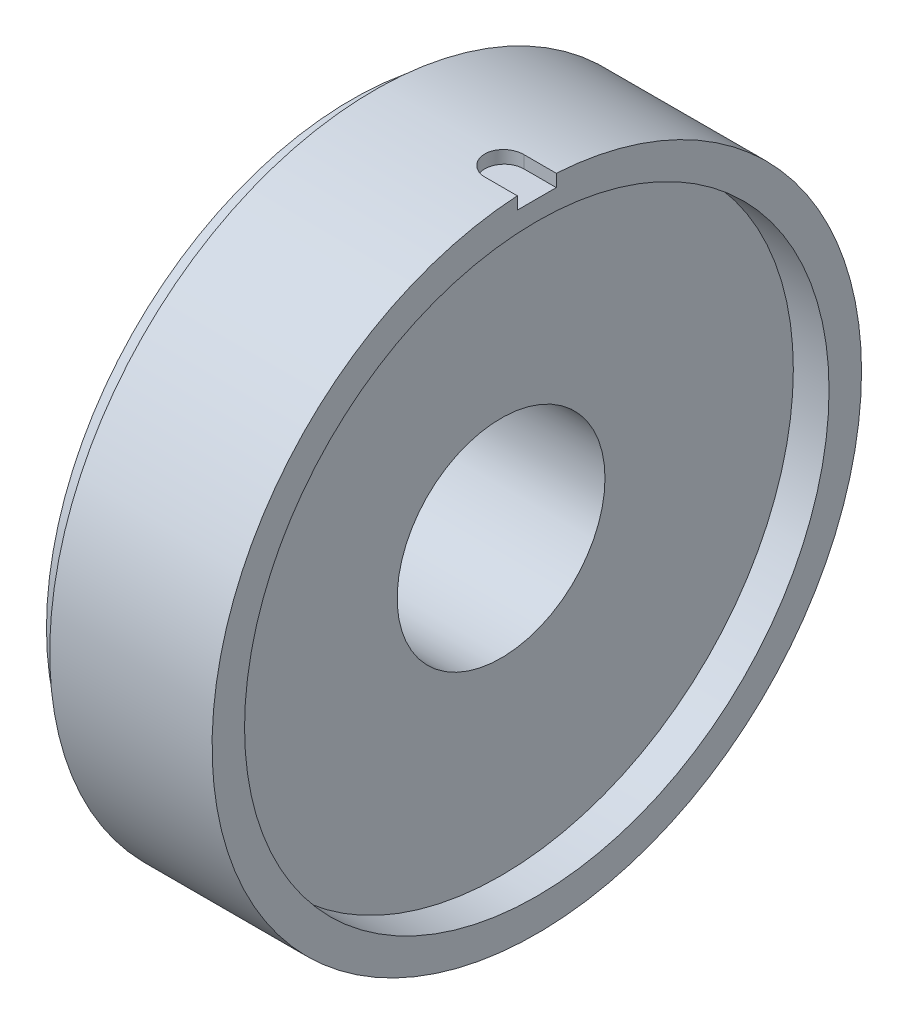
ISO-10303-21;
HEADER;
FILE_DESCRIPTION(('STEP AP214'),'2;1');
FILE_NAME('part.step','',(''),(''),'','','');
FILE_SCHEMA(('AUTOMOTIVE_DESIGN { 1 0 10303 214 1 1 1 1 }'));
ENDSEC;
DATA;
#1=APPLICATION_CONTEXT('core data for automotive mechanical design processes');
#2=APPLICATION_PROTOCOL_DEFINITION('international standard','automotive_design',2000,#1);
#3=PRODUCT_CONTEXT('',#1,'mechanical');
#4=PRODUCT('Part','Part','',(#3));
#5=PRODUCT_RELATED_PRODUCT_CATEGORY('part','',(#4));
#6=PRODUCT_DEFINITION_FORMATION('','',#4);
#7=PRODUCT_DEFINITION_CONTEXT('part definition',#1,'design');
#8=PRODUCT_DEFINITION('design','',#6,#7);
#9=PRODUCT_DEFINITION_SHAPE('','',#8);
#10=(LENGTH_UNIT() NAMED_UNIT(*) SI_UNIT(.MILLI.,.METRE.));
#11=(NAMED_UNIT(*) PLANE_ANGLE_UNIT() SI_UNIT($,.RADIAN.));
#12=(NAMED_UNIT(*) SI_UNIT($,.STERADIAN.) SOLID_ANGLE_UNIT());
#13=UNCERTAINTY_MEASURE_WITH_UNIT(LENGTH_MEASURE(1.E-05),#10,'distance_accuracy_value','');
#14=(GEOMETRIC_REPRESENTATION_CONTEXT(3) GLOBAL_UNCERTAINTY_ASSIGNED_CONTEXT((#13)) GLOBAL_UNIT_ASSIGNED_CONTEXT((#10,
#11,#12)) REPRESENTATION_CONTEXT('',''));
#15=CARTESIAN_POINT('',(0.,0.,0.));
#16=DIRECTION('',(0.,0.,1.));
#17=DIRECTION('',(1.,0.,0.));
#18=AXIS2_PLACEMENT_3D('',#15,#16,#17);
#19=CARTESIAN_POINT('',(-172.8050286243,0.,0.));
#20=DIRECTION('',(1.,0.,0.));
#21=DIRECTION('',(0.,0.,-1.));
#22=AXIS2_PLACEMENT_3D('',#19,#20,#21);
#23=CYLINDRICAL_SURFACE('',#22,45.);
#24=CARTESIAN_POINT('',(0.,0.,0.));
#25=DIRECTION('',(1.,0.,0.));
#26=DIRECTION('',(0.,0.,-1.));
#27=AXIS2_PLACEMENT_3D('',#24,#25,#26);
#28=CIRCLE('',#27,45.);
#29=CARTESIAN_POINT('',(0.,0.,-45.));
#30=VERTEX_POINT('',#29);
#31=EDGE_CURVE('E74',#30,#30,#28,.F.);
#32=ORIENTED_EDGE('',*,*,#31,.F.);
#33=EDGE_LOOP('',(#32));
#34=FACE_BOUND('',#33,.T.);
#35=CARTESIAN_POINT('',(-5.5,0.,0.));
#36=DIRECTION('',(1.,0.,0.));
#37=DIRECTION('',(0.,0.,-1.));
#38=AXIS2_PLACEMENT_3D('',#35,#36,#37);
#39=CIRCLE('',#38,45.);
#40=CARTESIAN_POINT('',(-5.5,0.,-45.));
#41=VERTEX_POINT('',#40);
#42=EDGE_CURVE('E11',#41,#41,#39,.F.);
#43=ORIENTED_EDGE('',*,*,#42,.T.);
#44=EDGE_LOOP('',(#43));
#45=FACE_BOUND('',#44,.T.);
#46=ADVANCED_FACE('F16',(#34,#45),#23,.F.);
#47=CARTESIAN_POINT('',(-28.5,0.,0.));
#48=DIRECTION('',(1.,0.,0.));
#49=DIRECTION('',(0.,0.,-1.));
#50=AXIS2_PLACEMENT_3D('',#47,#48,#49);
#51=PLANE('',#50);
#52=CARTESIAN_POINT('',(-28.5,0.,0.));
#53=DIRECTION('',(1.,0.,0.));
#54=DIRECTION('',(0.,0.,-1.));
#55=AXIS2_PLACEMENT_3D('',#52,#53,#54);
#56=CIRCLE('',#55,47.);
#57=CARTESIAN_POINT('',(-28.5,0.,-47.));
#58=VERTEX_POINT('',#57);
#59=EDGE_CURVE('E80',#58,#58,#56,.T.);
#60=ORIENTED_EDGE('',*,*,#59,.F.);
#61=EDGE_LOOP('',(#60));
#62=FACE_BOUND('',#61,.T.);
#63=CARTESIAN_POINT('',(-28.5,0.,0.));
#64=DIRECTION('',(1.,0.,0.));
#65=DIRECTION('',(0.,0.,-1.));
#66=AXIS2_PLACEMENT_3D('',#63,#64,#65);
#67=CIRCLE('',#66,16.);
#68=CARTESIAN_POINT('',(-28.5,0.,-16.));
#69=VERTEX_POINT('',#68);
#70=EDGE_CURVE('E92',#69,#69,#67,.T.);
#71=ORIENTED_EDGE('',*,*,#70,.T.);
#72=EDGE_LOOP('',(#71));
#73=FACE_BOUND('',#72,.T.);
#74=ADVANCED_FACE('F118',(#62,#73),#51,.F.);
#75=CARTESIAN_POINT('',(-172.8050286243,0.,0.));
#76=DIRECTION('',(1.,0.,0.));
#77=DIRECTION('',(0.,0.,-1.));
#78=AXIS2_PLACEMENT_3D('',#75,#76,#77);
#79=CYLINDRICAL_SURFACE('',#78,16.);
#80=ORIENTED_EDGE('',*,*,#70,.F.);
#81=EDGE_LOOP('',(#80));
#82=FACE_BOUND('',#81,.T.);
#83=CARTESIAN_POINT('',(-5.5,0.,0.));
#84=DIRECTION('',(1.,0.,0.));
#85=DIRECTION('',(0.,0.,-1.));
#86=AXIS2_PLACEMENT_3D('',#83,#84,#85);
#87=CIRCLE('',#86,16.);
#88=CARTESIAN_POINT('',(-5.5,0.,-16.));
#89=VERTEX_POINT('',#88);
#90=EDGE_CURVE('E25',#89,#89,#87,.T.);
#91=ORIENTED_EDGE('',*,*,#90,.T.);
#92=EDGE_LOOP('',(#91));
#93=FACE_BOUND('',#92,.T.);
#94=ADVANCED_FACE('F139',(#82,#93),#79,.F.);
#95=CARTESIAN_POINT('',(-5.5,0.,0.));
#96=DIRECTION('',(1.,0.,0.));
#97=DIRECTION('',(0.,0.,-1.));
#98=AXIS2_PLACEMENT_3D('',#95,#96,#97);
#99=PLANE('',#98);
#100=ORIENTED_EDGE('',*,*,#42,.F.);
#101=EDGE_LOOP('',(#100));
#102=FACE_BOUND('',#101,.T.);
#103=ORIENTED_EDGE('',*,*,#90,.F.);
#104=EDGE_LOOP('',(#103));
#105=FACE_BOUND('',#104,.T.);
#106=ADVANCED_FACE('F18',(#102,#105),#99,.T.);
#107=CARTESIAN_POINT('',(0.,48.,0.));
#108=DIRECTION('',(0.,1.,0.));
#109=DIRECTION('',(0.,0.,1.));
#110=AXIS2_PLACEMENT_3D('',#107,#108,#109);
#111=PLANE('',#110);
#112=DIRECTION('',(1.,0.,0.));
#113=VECTOR('',#112,1.);
#114=CARTESIAN_POINT('',(-5.,48.,3.));
#115=LINE('',#114,#113);
#116=CARTESIAN_POINT('',(-5.,48.,3.));
#117=VERTEX_POINT('',#116);
#118=CARTESIAN_POINT('',(0.,48.,3.));
#119=VERTEX_POINT('',#118);
#120=EDGE_CURVE('E58',#117,#119,#115,.T.);
#121=ORIENTED_EDGE('',*,*,#120,.T.);
#122=DIRECTION('',(0.,0.,-1.));
#123=VECTOR('',#122,1.);
#124=CARTESIAN_POINT('',(0.,48.,0.));
#125=LINE('',#124,#123);
#126=CARTESIAN_POINT('',(0.,48.,-3.));
#127=VERTEX_POINT('',#126);
#128=EDGE_CURVE('E70',#127,#119,#125,.F.);
#129=ORIENTED_EDGE('',*,*,#128,.F.);
#130=DIRECTION('',(-1.,0.,0.));
#131=VECTOR('',#130,1.);
#132=CARTESIAN_POINT('',(0.,48.,-3.));
#133=LINE('',#132,#131);
#134=CARTESIAN_POINT('',(-5.,48.,-3.));
#135=VERTEX_POINT('',#134);
#136=EDGE_CURVE('E52',#127,#135,#133,.T.);
#137=ORIENTED_EDGE('',*,*,#136,.T.);
#138=CARTESIAN_POINT('',(-5.,48.,0.));
#139=DIRECTION('',(0.,1.,0.));
#140=DIRECTION('',(0.,0.,1.));
#141=AXIS2_PLACEMENT_3D('',#138,#139,#140);
#142=CIRCLE('',#141,3.);
#143=EDGE_CURVE('E57',#135,#117,#142,.T.);
#144=ORIENTED_EDGE('',*,*,#143,.T.);
#145=EDGE_LOOP('',(#121,#129,#137,#144));
#146=FACE_BOUND('',#145,.T.);
#147=ADVANCED_FACE('F71',(#146),#111,.T.);
#148=CARTESIAN_POINT('',(0.,55.,-3.));
#149=DIRECTION('',(0.,0.,-1.));
#150=DIRECTION('',(-1.,0.,0.));
#151=AXIS2_PLACEMENT_3D('',#148,#149,#150);
#152=PLANE('',#151);
#153=DIRECTION('',(0.,1.,0.));
#154=VECTOR('',#153,1.);
#155=CARTESIAN_POINT('',(-5.,55.,-3.));
#156=LINE('',#155,#154);
#157=CARTESIAN_POINT('',(-5.,49.9099188538711,-3.00000000000004));
#158=VERTEX_POINT('',#157);
#159=EDGE_CURVE('E67',#158,#135,#156,.F.);
#160=ORIENTED_EDGE('',*,*,#159,.T.);
#161=ORIENTED_EDGE('',*,*,#136,.F.);
#162=DIRECTION('',(0.,1.,0.));
#163=VECTOR('',#162,1.);
#164=CARTESIAN_POINT('',(0.,0.,-3.));
#165=LINE('',#164,#163);
#166=CARTESIAN_POINT('',(0.,49.9099188538711,-3.00000000000004));
#167=VERTEX_POINT('',#166);
#168=EDGE_CURVE('E64',#167,#127,#165,.F.);
#169=ORIENTED_EDGE('',*,*,#168,.F.);
#170=DIRECTION('',(1.,0.,0.));
#171=VECTOR('',#170,1.);
#172=CARTESIAN_POINT('',(0.,49.9099188538711,-3.00000000000007));
#173=LINE('',#172,#171);
#174=EDGE_CURVE('E83',#158,#167,#173,.T.);
#175=ORIENTED_EDGE('',*,*,#174,.F.);
#176=EDGE_LOOP('',(#160,#161,#169,#175));
#177=FACE_BOUND('',#176,.T.);
#178=ADVANCED_FACE('F62',(#177),#152,.F.);
#179=CARTESIAN_POINT('',(-5.,55.,3.));
#180=DIRECTION('',(0.,0.,1.));
#181=DIRECTION('',(1.,0.,0.));
#182=AXIS2_PLACEMENT_3D('',#179,#180,#181);
#183=PLANE('',#182);
#184=DIRECTION('',(0.,1.,0.));
#185=VECTOR('',#184,1.);
#186=CARTESIAN_POINT('',(-5.,55.,3.));
#187=LINE('',#186,#185);
#188=CARTESIAN_POINT('',(-5.,49.9099188538711,3.));
#189=VERTEX_POINT('',#188);
#190=EDGE_CURVE('E33',#117,#189,#187,.T.);
#191=ORIENTED_EDGE('',*,*,#190,.T.);
#192=DIRECTION('',(1.,0.,0.));
#193=VECTOR('',#192,1.);
#194=CARTESIAN_POINT('',(0.,49.9099188538711,3.00000000000007));
#195=LINE('',#194,#193);
#196=CARTESIAN_POINT('',(0.,49.9099188538711,3.00000000000004));
#197=VERTEX_POINT('',#196);
#198=EDGE_CURVE('E106',#197,#189,#195,.F.);
#199=ORIENTED_EDGE('',*,*,#198,.F.);
#200=DIRECTION('',(0.,1.,0.));
#201=VECTOR('',#200,1.);
#202=CARTESIAN_POINT('',(0.,0.,3.));
#203=LINE('',#202,#201);
#204=EDGE_CURVE('E78',#119,#197,#203,.T.);
#205=ORIENTED_EDGE('',*,*,#204,.F.);
#206=ORIENTED_EDGE('',*,*,#120,.F.);
#207=EDGE_LOOP('',(#191,#199,#205,#206));
#208=FACE_BOUND('',#207,.T.);
#209=ADVANCED_FACE('F131',(#208),#183,.F.);
#210=CARTESIAN_POINT('',(-5.,55.,0.));
#211=DIRECTION('',(0.,1.,0.));
#212=DIRECTION('',(0.,0.,1.));
#213=AXIS2_PLACEMENT_3D('',#210,#211,#212);
#214=CYLINDRICAL_SURFACE('',#213,3.);
#215=ORIENTED_EDGE('',*,*,#143,.F.);
#216=ORIENTED_EDGE('',*,*,#159,.F.);
#217=CARTESIAN_POINT('',(-5.,49.9099188538711,3.));
#218=CARTESIAN_POINT('',(-5.08429698991407,49.9099167696003,3.00000817176037));
#219=CARTESIAN_POINT('',(-5.16859004306017,49.9101323744583,2.99644704416238));
#220=CARTESIAN_POINT('',(-5.33657159611769,49.9109835694731,2.98224944584792));
#221=CARTESIAN_POINT('',(-5.42026012874891,49.9116191367244,2.97161336101004));
#222=CARTESIAN_POINT('',(-5.58638075139791,49.9132942159696,2.94334007439089));
#223=CARTESIAN_POINT('',(-5.6688137667467,49.9143334138585,2.92570831640862));
#224=CARTESIAN_POINT('',(-5.83187857937101,49.916784367725,2.88358789587794));
#225=CARTESIAN_POINT('',(-5.9125103959775,49.9181961197023,2.85909930695716));
#226=CARTESIAN_POINT('',(-6.15091913856304,49.9229354110529,2.77555094759395));
#227=CARTESIAN_POINT('',(-6.30528514231072,49.9267678031947,2.70639561442257));
#228=CARTESIAN_POINT('',(-6.60010509624288,49.9353435928083,2.54324318725836));
#229=CARTESIAN_POINT('',(-6.74056139275699,49.940086836237,2.4492502927832));
#230=CARTESIAN_POINT('',(-7.00389740200565,49.9499575706838,2.23892934645357));
#231=CARTESIAN_POINT('',(-7.12675682924285,49.9550854949497,2.12257587352568));
#232=CARTESIAN_POINT('',(-7.35122314648647,49.965144211811,1.87088069186251));
#233=CARTESIAN_POINT('',(-7.45282679951919,49.9700749742889,1.73553609626572));
#234=CARTESIAN_POINT('',(-7.63195096956136,49.9791869785448,1.44959106756591));
#235=CARTESIAN_POINT('',(-7.70945425988128,49.9833676832905,1.29897982351725));
#236=CARTESIAN_POINT('',(-7.83806076068991,49.9905035177147,0.986862930622301));
#237=CARTESIAN_POINT('',(-7.88916585483271,49.9934587348354,0.825358060025207));
#238=CARTESIAN_POINT('',(-7.96347389570559,49.9978078442104,0.496234915064197));
#239=CARTESIAN_POINT('',(-7.98671018137042,49.9992036018798,0.328624192959481));
#240=CARTESIAN_POINT('',(-8.00472389780697,50.000282808427,-0.00812821034979145));
#241=CARTESIAN_POINT('',(-7.99950092621253,49.9999662330953,-0.177269913166093));
#242=CARTESIAN_POINT('',(-7.96077097517407,49.997657944263,-0.512047798838898));
#243=CARTESIAN_POINT('',(-7.92730069938975,49.9956684045719,-0.677688244962682));
#244=CARTESIAN_POINT('',(-7.83308327137179,49.990240720132,-1.00099472373468));
#245=CARTESIAN_POINT('',(-7.77233609099167,49.9868025738884,-1.15866074815406));
#246=CARTESIAN_POINT('',(-7.62524626214604,49.9788610076232,-1.46166456649139));
#247=CARTESIAN_POINT('',(-7.53888642774279,49.9743568727407,-1.60699399814341));
#248=CARTESIAN_POINT('',(-7.34303930691796,49.9647906066074,-1.88110019802217));
#249=CARTESIAN_POINT('',(-7.23355287563469,49.9597284959919,-2.00987757800107));
#250=CARTESIAN_POINT('',(-6.99437105202376,49.9496071078374,-2.24742900337992));
#251=CARTESIAN_POINT('',(-6.86464671938689,49.9445478449331,-2.35617390890131));
#252=CARTESIAN_POINT('',(-6.58871644633409,49.9350082072425,-2.55038118028788));
#253=CARTESIAN_POINT('',(-6.44250536785328,49.930528013861,-2.63583625941111));
#254=CARTESIAN_POINT('',(-6.13771485803747,49.9226518874553,-2.78103217413446));
#255=CARTESIAN_POINT('',(-5.97912740905456,49.9192566646731,-2.84075617455841));
#256=CARTESIAN_POINT('',(-5.65427295806918,49.9139442095002,-2.93263134569306));
#257=CARTESIAN_POINT('',(-5.48801805103327,49.9120247284036,-2.96482447584253));
#258=CARTESIAN_POINT('',(-5.26719758259727,49.9106052649442,-2.98856025092922));
#259=CARTESIAN_POINT('',(-5.21380142458181,49.9103480025785,-2.99285237792291));
#260=CARTESIAN_POINT('',(-5.10694412858701,49.9100050206764,-2.99856834903784));
#261=CARTESIAN_POINT('',(-5.05348324589025,49.9099190168924,-2.99999694594825));
#262=CARTESIAN_POINT('',(-5.,49.9099188538711,-3.));
#263=B_SPLINE_CURVE_WITH_KNOTS('',3,(#217,#218,#219,#220,#221,#222,#223,#224,#225,#226,#227,
#228,#229,#230,#231,#232,#233,#234,#235,#236,#237,#238,#239,#240,#241,#242,#243,#244,#245,#246,
#247,#248,#249,#250,#251,#252,#253,#254,#255,#256,#257,#258,#259,#260,#261,#262),.UNSPECIFIED.,
.F.,.F.,(4,2,2,2,2,2,2,2,2,2,2,2,2,2,2,2,2,2,2,2,2,2,4),(0.,0.252808425352418,0.505603063291675,
0.758201369500571,1.01079696345055,1.51576038323126,2.02063847871555,2.52609398733072,
3.03162641420245,3.53751936417832,4.04337621096741,4.54862730514019,5.05388554273439,
5.55848827264034,6.06309152323691,6.56803412859251,7.07295806625579,7.57861078065359,
8.08442151864208,8.59056269472771,9.09593108585342,9.25658383489436,9.41696971647332),.UNSPECIFIED.);
#264=EDGE_CURVE('E97',#189,#158,#263,.T.);
#265=ORIENTED_EDGE('',*,*,#264,.F.);
#266=ORIENTED_EDGE('',*,*,#190,.F.);
#267=EDGE_LOOP('',(#215,#216,#265,#266));
#268=FACE_BOUND('',#267,.T.);
#269=ADVANCED_FACE('F108',(#268),#214,.F.);
#270=CARTESIAN_POINT('',(-172.8050286243,0.,0.));
#271=DIRECTION('',(1.,0.,0.));
#272=DIRECTION('',(0.,0.,-1.));
#273=AXIS2_PLACEMENT_3D('',#270,#271,#272);
#274=CYLINDRICAL_SURFACE('',#273,47.);
#275=CARTESIAN_POINT('',(-25.,0.,0.));
#276=DIRECTION('',(1.,0.,0.));
#277=DIRECTION('',(0.,0.,-1.));
#278=AXIS2_PLACEMENT_3D('',#275,#276,#277);
#279=CIRCLE('',#278,47.);
#280=CARTESIAN_POINT('',(-25.,0.,-47.));
#281=VERTEX_POINT('',#280);
#282=EDGE_CURVE('E94',#281,#281,#279,.F.);
#283=ORIENTED_EDGE('',*,*,#282,.T.);
#284=EDGE_LOOP('',(#283));
#285=FACE_BOUND('',#284,.T.);
#286=ORIENTED_EDGE('',*,*,#59,.T.);
#287=EDGE_LOOP('',(#286));
#288=FACE_BOUND('',#287,.T.);
#289=ADVANCED_FACE('F123',(#285,#288),#274,.T.);
#290=CARTESIAN_POINT('',(0.,0.,0.));
#291=DIRECTION('',(1.,0.,0.));
#292=DIRECTION('',(0.,0.,-1.));
#293=AXIS2_PLACEMENT_3D('',#290,#291,#292);
#294=PLANE('',#293);
#295=ORIENTED_EDGE('',*,*,#31,.T.);
#296=EDGE_LOOP('',(#295));
#297=FACE_BOUND('',#296,.T.);
#298=ORIENTED_EDGE('',*,*,#168,.T.);
#299=ORIENTED_EDGE('',*,*,#128,.T.);
#300=ORIENTED_EDGE('',*,*,#204,.T.);
#301=CARTESIAN_POINT('',(0.,0.,0.));
#302=DIRECTION('',(1.,0.,0.));
#303=DIRECTION('',(0.,0.,-1.));
#304=AXIS2_PLACEMENT_3D('',#301,#302,#303);
#305=CIRCLE('',#304,50.);
#306=EDGE_CURVE('E77',#167,#197,#305,.F.);
#307=ORIENTED_EDGE('',*,*,#306,.F.);
#308=EDGE_LOOP('',(#298,#299,#300,#307));
#309=FACE_BOUND('',#308,.T.);
#310=ADVANCED_FACE('F76',(#297,#309),#294,.T.);
#311=CARTESIAN_POINT('',(-25.,0.,0.));
#312=DIRECTION('',(1.,0.,0.));
#313=DIRECTION('',(0.,0.,-1.));
#314=AXIS2_PLACEMENT_3D('',#311,#312,#313);
#315=PLANE('',#314);
#316=ORIENTED_EDGE('',*,*,#282,.F.);
#317=EDGE_LOOP('',(#316));
#318=FACE_BOUND('',#317,.T.);
#319=CARTESIAN_POINT('',(-25.,0.,0.));
#320=DIRECTION('',(1.,0.,0.));
#321=DIRECTION('',(0.,0.,-1.));
#322=AXIS2_PLACEMENT_3D('',#319,#320,#321);
#323=CIRCLE('',#322,50.);
#324=CARTESIAN_POINT('',(-25.,0.,-50.));
#325=VERTEX_POINT('',#324);
#326=EDGE_CURVE('E89',#325,#325,#323,.T.);
#327=ORIENTED_EDGE('',*,*,#326,.F.);
#328=EDGE_LOOP('',(#327));
#329=FACE_BOUND('',#328,.T.);
#330=ADVANCED_FACE('F116',(#318,#329),#315,.F.);
#331=CARTESIAN_POINT('',(0.,0.,0.));
#332=DIRECTION('',(1.,0.,0.));
#333=DIRECTION('',(0.,0.,-1.));
#334=AXIS2_PLACEMENT_3D('',#331,#332,#333);
#335=CYLINDRICAL_SURFACE('',#334,50.);
#336=ORIENTED_EDGE('',*,*,#174,.T.);
#337=ORIENTED_EDGE('',*,*,#306,.T.);
#338=ORIENTED_EDGE('',*,*,#198,.T.);
#339=ORIENTED_EDGE('',*,*,#264,.T.);
#340=EDGE_LOOP('',(#336,#337,#338,#339));
#341=FACE_BOUND('',#340,.T.);
#342=ORIENTED_EDGE('',*,*,#326,.T.);
#343=EDGE_LOOP('',(#342));
#344=FACE_BOUND('',#343,.T.);
#345=ADVANCED_FACE('F112',(#341,#344),#335,.T.);
#346=CLOSED_SHELL('',(#46,#74,#94,#106,#147,#178,#209,#269,#289,#310,#330,#345));
#347=MANIFOLD_SOLID_BREP('B1',#346);
#348=ADVANCED_BREP_SHAPE_REPRESENTATION('',(#18,#347),#14);
#349=SHAPE_DEFINITION_REPRESENTATION(#9,#348);
ENDSEC;
END-ISO-10303-21;
